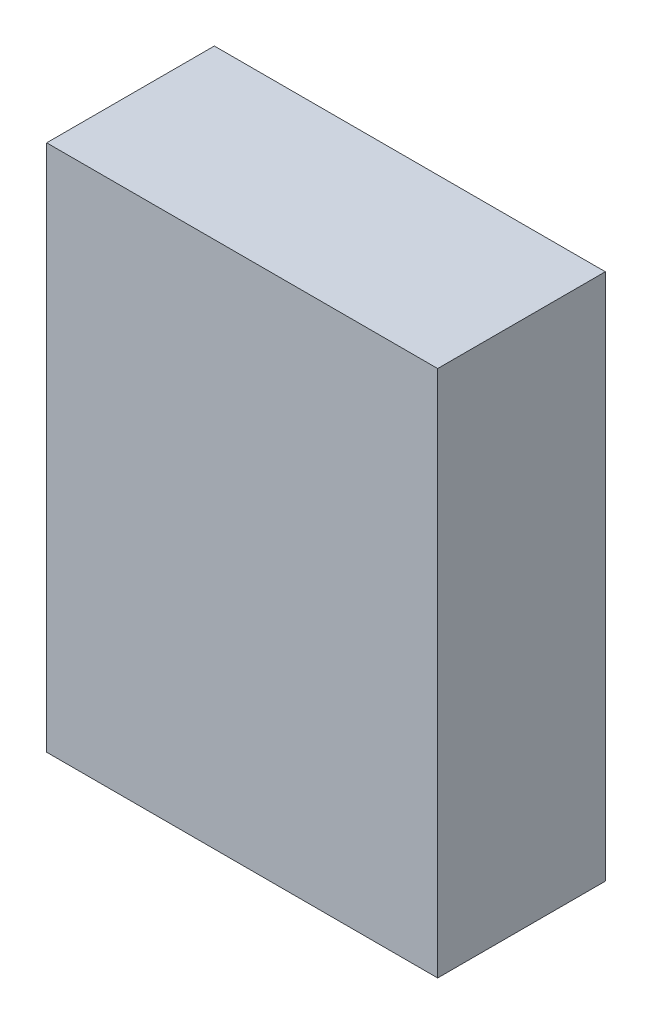
ISO-10303-21;
HEADER;
FILE_DESCRIPTION(('STEP AP214'),'2;1');
FILE_NAME('part.step','',(''),(''),'','','');
FILE_SCHEMA(('AUTOMOTIVE_DESIGN { 1 0 10303 214 1 1 1 1 }'));
ENDSEC;
DATA;
#1=APPLICATION_CONTEXT('core data for automotive mechanical design processes');
#2=APPLICATION_PROTOCOL_DEFINITION('international standard','automotive_design',2000,#1);
#3=PRODUCT_CONTEXT('',#1,'mechanical');
#4=PRODUCT('Part','Part','',(#3));
#5=PRODUCT_RELATED_PRODUCT_CATEGORY('part','',(#4));
#6=PRODUCT_DEFINITION_FORMATION('','',#4);
#7=PRODUCT_DEFINITION_CONTEXT('part definition',#1,'design');
#8=PRODUCT_DEFINITION('design','',#6,#7);
#9=PRODUCT_DEFINITION_SHAPE('','',#8);
#10=(LENGTH_UNIT() NAMED_UNIT(*) SI_UNIT(.MILLI.,.METRE.));
#11=(NAMED_UNIT(*) PLANE_ANGLE_UNIT() SI_UNIT($,.RADIAN.));
#12=(NAMED_UNIT(*) SI_UNIT($,.STERADIAN.) SOLID_ANGLE_UNIT());
#13=UNCERTAINTY_MEASURE_WITH_UNIT(LENGTH_MEASURE(1.E-05),#10,'distance_accuracy_value','');
#14=(GEOMETRIC_REPRESENTATION_CONTEXT(3) GLOBAL_UNCERTAINTY_ASSIGNED_CONTEXT((#13)) GLOBAL_UNIT_ASSIGNED_CONTEXT((#10,
#11,#12)) REPRESENTATION_CONTEXT('',''));
#15=CARTESIAN_POINT('',(0.,0.,0.));
#16=DIRECTION('',(0.,0.,1.));
#17=DIRECTION('',(1.,0.,0.));
#18=AXIS2_PLACEMENT_3D('',#15,#16,#17);
#19=CARTESIAN_POINT('',(-0.87448898,1.18051072,0.));
#20=DIRECTION('',(0.,1.,0.));
#21=DIRECTION('',(1.,0.,0.));
#22=AXIS2_PLACEMENT_3D('',#19,#20,#21);
#23=PLANE('',#22);
#24=DIRECTION('',(0.,0.,1.));
#25=VECTOR('',#24,1.);
#26=CARTESIAN_POINT('',(-0.87448898,1.18051072,0.));
#27=LINE('',#26,#25);
#28=CARTESIAN_POINT('',(-0.87448898,1.18051072,0.));
#29=VERTEX_POINT('',#28);
#30=CARTESIAN_POINT('',(-0.87448898,1.18051072,0.75000104));
#31=VERTEX_POINT('',#30);
#32=EDGE_CURVE('E10',#29,#31,#27,.T.);
#33=ORIENTED_EDGE('',*,*,#32,.T.);
#34=DIRECTION('',(1.,0.,0.));
#35=VECTOR('',#34,1.);
#36=CARTESIAN_POINT('',(-0.87448898,1.18051072,0.75000104));
#37=LINE('',#36,#35);
#38=CARTESIAN_POINT('',(0.87449152,1.18051072,0.75000104));
#39=VERTEX_POINT('',#38);
#40=EDGE_CURVE('E23',#31,#39,#37,.T.);
#41=ORIENTED_EDGE('',*,*,#40,.T.);
#42=DIRECTION('',(0.,0.,1.));
#43=VECTOR('',#42,1.);
#44=CARTESIAN_POINT('',(0.87449152,1.18051072,0.));
#45=LINE('',#44,#43);
#46=CARTESIAN_POINT('',(0.87449152,1.18051072,0.));
#47=VERTEX_POINT('',#46);
#48=EDGE_CURVE('E84',#47,#39,#45,.T.);
#49=ORIENTED_EDGE('',*,*,#48,.F.);
#50=DIRECTION('',(1.,0.,0.));
#51=VECTOR('',#50,1.);
#52=CARTESIAN_POINT('',(-0.87448898,1.18051072,0.));
#53=LINE('',#52,#51);
#54=EDGE_CURVE('E82',#29,#47,#53,.T.);
#55=ORIENTED_EDGE('',*,*,#54,.F.);
#56=EDGE_LOOP('',(#33,#41,#49,#55));
#57=FACE_BOUND('',#56,.T.);
#58=ADVANCED_FACE('F16',(#57),#23,.T.);
#59=CARTESIAN_POINT('',(0.87449152,1.18051072,0.));
#60=DIRECTION('',(1.,0.,0.));
#61=DIRECTION('',(0.,-1.,0.));
#62=AXIS2_PLACEMENT_3D('',#59,#60,#61);
#63=PLANE('',#62);
#64=ORIENTED_EDGE('',*,*,#48,.T.);
#65=DIRECTION('',(0.,-1.,0.));
#66=VECTOR('',#65,1.);
#67=CARTESIAN_POINT('',(0.87449152,1.18051072,0.75000104));
#68=LINE('',#67,#66);
#69=CARTESIAN_POINT('',(0.87449152,-1.18050818,0.75000104));
#70=VERTEX_POINT('',#69);
#71=EDGE_CURVE('E80',#39,#70,#68,.T.);
#72=ORIENTED_EDGE('',*,*,#71,.T.);
#73=DIRECTION('',(0.,0.,1.));
#74=VECTOR('',#73,1.);
#75=CARTESIAN_POINT('',(0.87449152,-1.18050818,0.));
#76=LINE('',#75,#74);
#77=CARTESIAN_POINT('',(0.87449152,-1.18050818,0.));
#78=VERTEX_POINT('',#77);
#79=EDGE_CURVE('E78',#78,#70,#76,.T.);
#80=ORIENTED_EDGE('',*,*,#79,.F.);
#81=DIRECTION('',(0.,-1.,0.));
#82=VECTOR('',#81,1.);
#83=CARTESIAN_POINT('',(0.87449152,1.18051072,0.));
#84=LINE('',#83,#82);
#85=EDGE_CURVE('E69',#47,#78,#84,.T.);
#86=ORIENTED_EDGE('',*,*,#85,.F.);
#87=EDGE_LOOP('',(#64,#72,#80,#86));
#88=FACE_BOUND('',#87,.T.);
#89=ADVANCED_FACE('F89',(#88),#63,.T.);
#90=CARTESIAN_POINT('',(0.87449152,-1.18050818,0.));
#91=DIRECTION('',(-1.45227462341292E-06,-0.999999999998946,0.));
#92=DIRECTION('',(-0.999999999998946,1.45227462341292E-06,0.));
#93=AXIS2_PLACEMENT_3D('',#90,#91,#92);
#94=PLANE('',#93);
#95=ORIENTED_EDGE('',*,*,#79,.T.);
#96=DIRECTION('',(-0.999999999998946,1.45227462341292E-06,0.));
#97=VECTOR('',#96,1.);
#98=CARTESIAN_POINT('',(0.87449152,-1.18050818,0.75000104));
#99=LINE('',#98,#97);
#100=CARTESIAN_POINT('',(-0.87448898,-1.18050564,0.75000104));
#101=VERTEX_POINT('',#100);
#102=EDGE_CURVE('E59',#70,#101,#99,.T.);
#103=ORIENTED_EDGE('',*,*,#102,.T.);
#104=DIRECTION('',(0.,0.,1.));
#105=VECTOR('',#104,1.);
#106=CARTESIAN_POINT('',(-0.87448898,-1.18050564,0.));
#107=LINE('',#106,#105);
#108=CARTESIAN_POINT('',(-0.87448898,-1.18050564,0.));
#109=VERTEX_POINT('',#108);
#110=EDGE_CURVE('E53',#109,#101,#107,.T.);
#111=ORIENTED_EDGE('',*,*,#110,.F.);
#112=DIRECTION('',(-0.999999999998946,1.45227462341292E-06,0.));
#113=VECTOR('',#112,1.);
#114=CARTESIAN_POINT('',(0.87449152,-1.18050818,0.));
#115=LINE('',#114,#113);
#116=EDGE_CURVE('E57',#78,#109,#115,.T.);
#117=ORIENTED_EDGE('',*,*,#116,.F.);
#118=EDGE_LOOP('',(#95,#103,#111,#117));
#119=FACE_BOUND('',#118,.T.);
#120=ADVANCED_FACE('F56',(#119),#94,.T.);
#121=CARTESIAN_POINT('',(-0.87448898,-1.18050564,0.));
#122=DIRECTION('',(-1.,0.,0.));
#123=DIRECTION('',(0.,1.,0.));
#124=AXIS2_PLACEMENT_3D('',#121,#122,#123);
#125=PLANE('',#124);
#126=ORIENTED_EDGE('',*,*,#110,.T.);
#127=DIRECTION('',(0.,1.,0.));
#128=VECTOR('',#127,1.);
#129=CARTESIAN_POINT('',(-0.87448898,-1.18050564,0.75000104));
#130=LINE('',#129,#128);
#131=EDGE_CURVE('E70',#101,#31,#130,.T.);
#132=ORIENTED_EDGE('',*,*,#131,.T.);
#133=ORIENTED_EDGE('',*,*,#32,.F.);
#134=DIRECTION('',(0.,1.,0.));
#135=VECTOR('',#134,1.);
#136=CARTESIAN_POINT('',(-0.87448898,-1.18050564,0.));
#137=LINE('',#136,#135);
#138=EDGE_CURVE('E67',#109,#29,#137,.T.);
#139=ORIENTED_EDGE('',*,*,#138,.F.);
#140=EDGE_LOOP('',(#126,#132,#133,#139));
#141=FACE_BOUND('',#140,.T.);
#142=ADVANCED_FACE('F72',(#141),#125,.T.);
#143=CARTESIAN_POINT('',(-0.87448898,1.18051072,0.));
#144=DIRECTION('',(0.,0.,1.));
#145=DIRECTION('',(1.,0.,0.));
#146=AXIS2_PLACEMENT_3D('',#143,#144,#145);
#147=PLANE('',#146);
#148=ORIENTED_EDGE('',*,*,#54,.T.);
#149=ORIENTED_EDGE('',*,*,#85,.T.);
#150=ORIENTED_EDGE('',*,*,#116,.T.);
#151=ORIENTED_EDGE('',*,*,#138,.T.);
#152=EDGE_LOOP('',(#148,#149,#150,#151));
#153=FACE_BOUND('',#152,.T.);
#154=ADVANCED_FACE('F66',(#153),#147,.F.);
#155=CARTESIAN_POINT('',(-0.87448898,1.18051072,0.75000104));
#156=DIRECTION('',(0.,0.,1.));
#157=DIRECTION('',(1.,0.,0.));
#158=AXIS2_PLACEMENT_3D('',#155,#156,#157);
#159=PLANE('',#158);
#160=ORIENTED_EDGE('',*,*,#131,.F.);
#161=ORIENTED_EDGE('',*,*,#102,.F.);
#162=ORIENTED_EDGE('',*,*,#71,.F.);
#163=ORIENTED_EDGE('',*,*,#40,.F.);
#164=EDGE_LOOP('',(#160,#161,#162,#163));
#165=FACE_BOUND('',#164,.T.);
#166=ADVANCED_FACE('F90',(#165),#159,.T.);
#167=CLOSED_SHELL('',(#58,#89,#120,#142,#154,#166));
#168=MANIFOLD_SOLID_BREP('B1',#167);
#169=ADVANCED_BREP_SHAPE_REPRESENTATION('',(#18,#168),#14);
#170=SHAPE_DEFINITION_REPRESENTATION(#9,#169);
ENDSEC;
END-ISO-10303-21;
